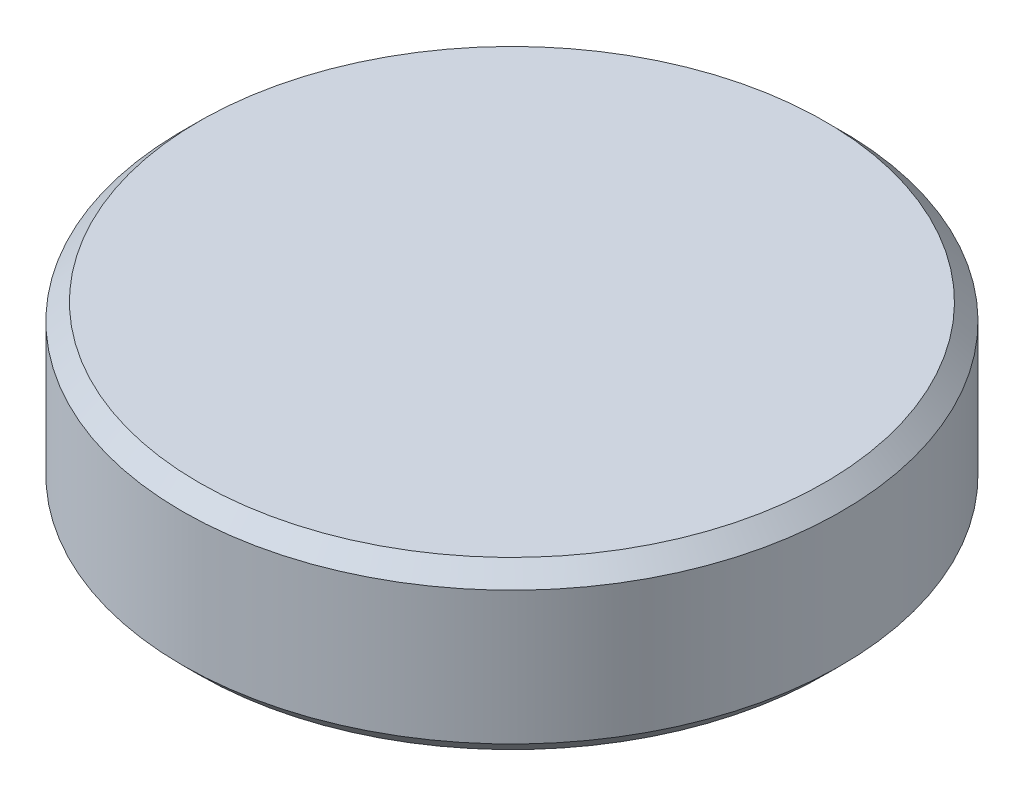
ISO-10303-21;
HEADER;
FILE_DESCRIPTION(('STEP AP214'),'2;1');
FILE_NAME('part.step','',(''),(''),'','','');
FILE_SCHEMA(('AUTOMOTIVE_DESIGN { 1 0 10303 214 1 1 1 1 }'));
ENDSEC;
DATA;
#1=APPLICATION_CONTEXT('core data for automotive mechanical design processes');
#2=APPLICATION_PROTOCOL_DEFINITION('international standard','automotive_design',2000,#1);
#3=PRODUCT_CONTEXT('',#1,'mechanical');
#4=PRODUCT('Part','Part','',(#3));
#5=PRODUCT_RELATED_PRODUCT_CATEGORY('part','',(#4));
#6=PRODUCT_DEFINITION_FORMATION('','',#4);
#7=PRODUCT_DEFINITION_CONTEXT('part definition',#1,'design');
#8=PRODUCT_DEFINITION('design','',#6,#7);
#9=PRODUCT_DEFINITION_SHAPE('','',#8);
#10=(LENGTH_UNIT() NAMED_UNIT(*) SI_UNIT(.MILLI.,.METRE.));
#11=(NAMED_UNIT(*) PLANE_ANGLE_UNIT() SI_UNIT($,.RADIAN.));
#12=(NAMED_UNIT(*) SI_UNIT($,.STERADIAN.) SOLID_ANGLE_UNIT());
#13=UNCERTAINTY_MEASURE_WITH_UNIT(LENGTH_MEASURE(1.E-05),#10,'distance_accuracy_value','');
#14=(GEOMETRIC_REPRESENTATION_CONTEXT(3) GLOBAL_UNCERTAINTY_ASSIGNED_CONTEXT((#13)) GLOBAL_UNIT_ASSIGNED_CONTEXT((#10,
#11,#12)) REPRESENTATION_CONTEXT('',''));
#15=CARTESIAN_POINT('',(0.,0.,0.));
#16=DIRECTION('',(0.,0.,1.));
#17=DIRECTION('',(1.,0.,0.));
#18=AXIS2_PLACEMENT_3D('',#15,#16,#17);
#19=CARTESIAN_POINT('',(0.,2.5,0.));
#20=DIRECTION('',(0.,-1.,0.));
#21=DIRECTION('',(0.,0.,-1.));
#22=AXIS2_PLACEMENT_3D('',#19,#20,#21);
#23=CYLINDRICAL_SURFACE('',#22,4.95);
#24=CARTESIAN_POINT('',(0.,0.250000000000001,0.));
#25=DIRECTION('',(0.,1.,0.));
#26=DIRECTION('',(0.,0.,1.));
#27=AXIS2_PLACEMENT_3D('',#24,#25,#26);
#28=CIRCLE('',#27,4.95);
#29=CARTESIAN_POINT('',(0.,0.250000000000001,4.95));
#30=VERTEX_POINT('',#29);
#31=EDGE_CURVE('E41',#30,#30,#28,.T.);
#32=ORIENTED_EDGE('',*,*,#31,.T.);
#33=EDGE_LOOP('',(#32));
#34=FACE_BOUND('',#33,.T.);
#35=CARTESIAN_POINT('',(0.,2.25,0.));
#36=DIRECTION('',(0.,1.,0.));
#37=DIRECTION('',(0.,0.,1.));
#38=AXIS2_PLACEMENT_3D('',#35,#36,#37);
#39=CIRCLE('',#38,4.95);
#40=CARTESIAN_POINT('',(0.,2.25,4.95));
#41=VERTEX_POINT('',#40);
#42=EDGE_CURVE('E45',#41,#41,#39,.F.);
#43=ORIENTED_EDGE('',*,*,#42,.T.);
#44=EDGE_LOOP('',(#43));
#45=FACE_BOUND('',#44,.T.);
#46=ADVANCED_FACE('F30',(#34,#45),#23,.T.);
#47=CARTESIAN_POINT('',(0.,2.5,0.));
#48=DIRECTION('',(0.,1.,0.));
#49=DIRECTION('',(0.,0.,1.));
#50=AXIS2_PLACEMENT_3D('',#47,#48,#49);
#51=PLANE('',#50);
#52=CARTESIAN_POINT('',(0.,2.5,0.));
#53=DIRECTION('',(0.,1.,0.));
#54=DIRECTION('',(0.,0.,1.));
#55=AXIS2_PLACEMENT_3D('',#52,#53,#54);
#56=CIRCLE('',#55,4.7);
#57=CARTESIAN_POINT('',(0.,2.5,4.7));
#58=VERTEX_POINT('',#57);
#59=EDGE_CURVE('E10',#58,#58,#56,.T.);
#60=ORIENTED_EDGE('',*,*,#59,.T.);
#61=EDGE_LOOP('',(#60));
#62=FACE_BOUND('',#61,.T.);
#63=ADVANCED_FACE('F61',(#62),#51,.T.);
#64=CARTESIAN_POINT('',(0.,0.,0.));
#65=DIRECTION('',(0.,1.,0.));
#66=DIRECTION('',(0.,0.,1.));
#67=AXIS2_PLACEMENT_3D('',#64,#65,#66);
#68=PLANE('',#67);
#69=CARTESIAN_POINT('',(0.,0.,0.));
#70=DIRECTION('',(0.,1.,0.));
#71=DIRECTION('',(0.,0.,1.));
#72=AXIS2_PLACEMENT_3D('',#69,#70,#71);
#73=CIRCLE('',#72,4.7);
#74=CARTESIAN_POINT('',(0.,0.,4.7));
#75=VERTEX_POINT('',#74);
#76=EDGE_CURVE('E37',#75,#75,#73,.F.);
#77=ORIENTED_EDGE('',*,*,#76,.T.);
#78=EDGE_LOOP('',(#77));
#79=FACE_BOUND('',#78,.T.);
#80=ADVANCED_FACE('F58',(#79),#68,.F.);
#81=CARTESIAN_POINT('',(0.,0.250000000000001,0.));
#82=DIRECTION('',(0.,1.,0.));
#83=DIRECTION('',(0.,0.,1.));
#84=AXIS2_PLACEMENT_3D('',#81,#82,#83);
#85=CONICAL_SURFACE('',#84,4.95,0.78539816339745);
#86=ORIENTED_EDGE('',*,*,#76,.F.);
#87=EDGE_LOOP('',(#86));
#88=FACE_BOUND('',#87,.T.);
#89=ORIENTED_EDGE('',*,*,#31,.F.);
#90=EDGE_LOOP('',(#89));
#91=FACE_BOUND('',#90,.T.);
#92=ADVANCED_FACE('F54',(#88,#91),#85,.T.);
#93=CARTESIAN_POINT('',(0.,2.5,0.));
#94=DIRECTION('',(0.,-1.,0.));
#95=DIRECTION('',(0.,0.,-1.));
#96=AXIS2_PLACEMENT_3D('',#93,#94,#95);
#97=CONICAL_SURFACE('',#96,4.7,0.785398163397448);
#98=ORIENTED_EDGE('',*,*,#42,.F.);
#99=EDGE_LOOP('',(#98));
#100=FACE_BOUND('',#99,.T.);
#101=ORIENTED_EDGE('',*,*,#59,.F.);
#102=EDGE_LOOP('',(#101));
#103=FACE_BOUND('',#102,.T.);
#104=ADVANCED_FACE('F32',(#100,#103),#97,.T.);
#105=CLOSED_SHELL('',(#46,#63,#80,#92,#104));
#106=MANIFOLD_SOLID_BREP('B2',#105);
#107=ADVANCED_BREP_SHAPE_REPRESENTATION('',(#18,#106),#14);
#108=SHAPE_DEFINITION_REPRESENTATION(#9,#107);
ENDSEC;
END-ISO-10303-21;
